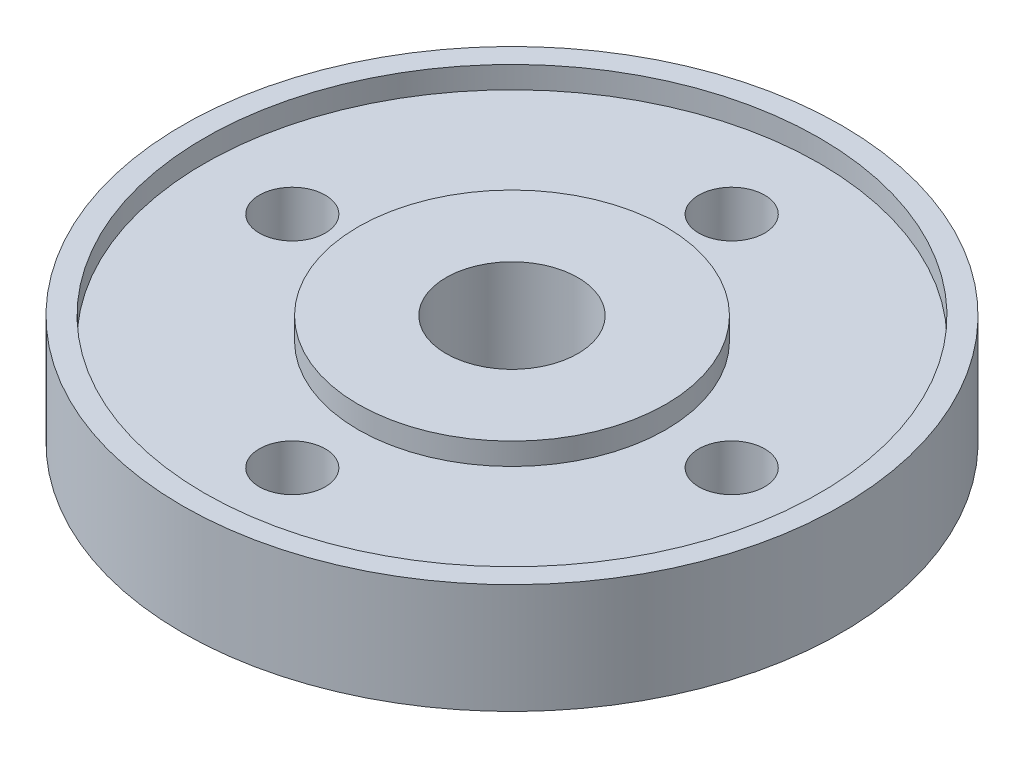
ISO-10303-21;
HEADER;
FILE_DESCRIPTION(('STEP AP214'),'2;1');
FILE_NAME('part.step','',(''),(''),'','','');
FILE_SCHEMA(('AUTOMOTIVE_DESIGN { 1 0 10303 214 1 1 1 1 }'));
ENDSEC;
DATA;
#1=APPLICATION_CONTEXT('core data for automotive mechanical design processes');
#2=APPLICATION_PROTOCOL_DEFINITION('international standard','automotive_design',2000,#1);
#3=PRODUCT_CONTEXT('',#1,'mechanical');
#4=PRODUCT('Part','Part','',(#3));
#5=PRODUCT_RELATED_PRODUCT_CATEGORY('part','',(#4));
#6=PRODUCT_DEFINITION_FORMATION('','',#4);
#7=PRODUCT_DEFINITION_CONTEXT('part definition',#1,'design');
#8=PRODUCT_DEFINITION('design','',#6,#7);
#9=PRODUCT_DEFINITION_SHAPE('','',#8);
#10=(LENGTH_UNIT() NAMED_UNIT(*) SI_UNIT(.MILLI.,.METRE.));
#11=(NAMED_UNIT(*) PLANE_ANGLE_UNIT() SI_UNIT($,.RADIAN.));
#12=(NAMED_UNIT(*) SI_UNIT($,.STERADIAN.) SOLID_ANGLE_UNIT());
#13=UNCERTAINTY_MEASURE_WITH_UNIT(LENGTH_MEASURE(1.E-05),#10,'distance_accuracy_value','');
#14=(GEOMETRIC_REPRESENTATION_CONTEXT(3) GLOBAL_UNCERTAINTY_ASSIGNED_CONTEXT((#13)) GLOBAL_UNIT_ASSIGNED_CONTEXT((#10,
#11,#12)) REPRESENTATION_CONTEXT('',''));
#15=CARTESIAN_POINT('',(0.,0.,0.));
#16=DIRECTION('',(0.,0.,1.));
#17=DIRECTION('',(1.,0.,0.));
#18=AXIS2_PLACEMENT_3D('',#15,#16,#17);
#19=CARTESIAN_POINT('',(0.,2.5,-10.));
#20=DIRECTION('',(0.,1.,0.));
#21=DIRECTION('',(0.,0.,1.));
#22=AXIS2_PLACEMENT_3D('',#19,#20,#21);
#23=CYLINDRICAL_SURFACE('',#22,1.5);
#24=CARTESIAN_POINT('',(0.,1.5,-10.));
#25=DIRECTION('',(0.,1.,0.));
#26=DIRECTION('',(0.,0.,1.));
#27=AXIS2_PLACEMENT_3D('',#24,#25,#26);
#28=CIRCLE('',#27,1.5);
#29=CARTESIAN_POINT('',(0.,1.5,-8.5));
#30=VERTEX_POINT('',#29);
#31=EDGE_CURVE('E72',#30,#30,#28,.F.);
#32=ORIENTED_EDGE('',*,*,#31,.F.);
#33=EDGE_LOOP('',(#32));
#34=FACE_BOUND('',#33,.T.);
#35=CARTESIAN_POINT('',(0.,-1.5,-10.));
#36=DIRECTION('',(0.,-1.,0.));
#37=DIRECTION('',(0.,0.,-1.));
#38=AXIS2_PLACEMENT_3D('',#35,#36,#37);
#39=CIRCLE('',#38,1.5);
#40=CARTESIAN_POINT('',(0.,-1.5,-11.5));
#41=VERTEX_POINT('',#40);
#42=EDGE_CURVE('E159',#41,#41,#39,.F.);
#43=ORIENTED_EDGE('',*,*,#42,.F.);
#44=EDGE_LOOP('',(#43));
#45=FACE_BOUND('',#44,.T.);
#46=ADVANCED_FACE('F31',(#34,#45),#23,.F.);
#47=CARTESIAN_POINT('',(10.,2.5,0.));
#48=DIRECTION('',(0.,1.,0.));
#49=DIRECTION('',(0.,0.,1.));
#50=AXIS2_PLACEMENT_3D('',#47,#48,#49);
#51=CYLINDRICAL_SURFACE('',#50,1.5);
#52=CARTESIAN_POINT('',(10.,1.5,0.));
#53=DIRECTION('',(0.,1.,0.));
#54=DIRECTION('',(0.,0.,1.));
#55=AXIS2_PLACEMENT_3D('',#52,#53,#54);
#56=CIRCLE('',#55,1.5);
#57=CARTESIAN_POINT('',(10.,1.5,1.50000000000003));
#58=VERTEX_POINT('',#57);
#59=EDGE_CURVE('E56',#58,#58,#56,.F.);
#60=ORIENTED_EDGE('',*,*,#59,.F.);
#61=EDGE_LOOP('',(#60));
#62=FACE_BOUND('',#61,.T.);
#63=CARTESIAN_POINT('',(10.,-1.5,0.));
#64=DIRECTION('',(0.,-1.,0.));
#65=DIRECTION('',(0.,0.,-1.));
#66=AXIS2_PLACEMENT_3D('',#63,#64,#65);
#67=CIRCLE('',#66,1.5);
#68=CARTESIAN_POINT('',(10.,-1.5,-1.49999999999996));
#69=VERTEX_POINT('',#68);
#70=EDGE_CURVE('E156',#69,#69,#67,.F.);
#71=ORIENTED_EDGE('',*,*,#70,.F.);
#72=EDGE_LOOP('',(#71));
#73=FACE_BOUND('',#72,.T.);
#74=ADVANCED_FACE('F99',(#62,#73),#51,.F.);
#75=CARTESIAN_POINT('',(0.,2.5,10.));
#76=DIRECTION('',(0.,1.,0.));
#77=DIRECTION('',(0.,0.,1.));
#78=AXIS2_PLACEMENT_3D('',#75,#76,#77);
#79=CYLINDRICAL_SURFACE('',#78,1.5);
#80=CARTESIAN_POINT('',(0.,1.5,10.));
#81=DIRECTION('',(0.,1.,0.));
#82=DIRECTION('',(0.,0.,1.));
#83=AXIS2_PLACEMENT_3D('',#80,#81,#82);
#84=CIRCLE('',#83,1.5);
#85=CARTESIAN_POINT('',(0.,1.5,11.5));
#86=VERTEX_POINT('',#85);
#87=EDGE_CURVE('E51',#86,#86,#84,.F.);
#88=ORIENTED_EDGE('',*,*,#87,.F.);
#89=EDGE_LOOP('',(#88));
#90=FACE_BOUND('',#89,.T.);
#91=CARTESIAN_POINT('',(0.,-1.5,10.));
#92=DIRECTION('',(0.,-1.,0.));
#93=DIRECTION('',(0.,0.,-1.));
#94=AXIS2_PLACEMENT_3D('',#91,#92,#93);
#95=CIRCLE('',#94,1.5);
#96=CARTESIAN_POINT('',(0.,-1.5,8.5));
#97=VERTEX_POINT('',#96);
#98=EDGE_CURVE('E153',#97,#97,#95,.F.);
#99=ORIENTED_EDGE('',*,*,#98,.F.);
#100=EDGE_LOOP('',(#99));
#101=FACE_BOUND('',#100,.T.);
#102=ADVANCED_FACE('F104',(#90,#101),#79,.F.);
#103=CARTESIAN_POINT('',(-10.,2.5,-1.04744440165294E-13));
#104=DIRECTION('',(0.,1.,0.));
#105=DIRECTION('',(0.,0.,1.));
#106=AXIS2_PLACEMENT_3D('',#103,#104,#105);
#107=CYLINDRICAL_SURFACE('',#106,1.5);
#108=CARTESIAN_POINT('',(-10.,1.5,-1.04744440165294E-13));
#109=DIRECTION('',(0.,1.,0.));
#110=DIRECTION('',(0.,0.,1.));
#111=AXIS2_PLACEMENT_3D('',#108,#109,#110);
#112=CIRCLE('',#111,1.5);
#113=CARTESIAN_POINT('',(-10.,1.5,1.49999999999989));
#114=VERTEX_POINT('',#113);
#115=EDGE_CURVE('E49',#114,#114,#112,.F.);
#116=ORIENTED_EDGE('',*,*,#115,.F.);
#117=EDGE_LOOP('',(#116));
#118=FACE_BOUND('',#117,.T.);
#119=CARTESIAN_POINT('',(-10.,-1.5,-1.04744440165294E-13));
#120=DIRECTION('',(0.,-1.,0.));
#121=DIRECTION('',(0.,0.,-1.));
#122=AXIS2_PLACEMENT_3D('',#119,#120,#121);
#123=CIRCLE('',#122,1.5);
#124=CARTESIAN_POINT('',(-10.,-1.5,-1.5000000000001));
#125=VERTEX_POINT('',#124);
#126=EDGE_CURVE('E35',#125,#125,#123,.F.);
#127=ORIENTED_EDGE('',*,*,#126,.F.);
#128=EDGE_LOOP('',(#127));
#129=FACE_BOUND('',#128,.T.);
#130=ADVANCED_FACE('F112',(#118,#129),#107,.F.);
#131=CARTESIAN_POINT('',(0.,-2.5,0.));
#132=DIRECTION('',(0.,1.,0.));
#133=DIRECTION('',(0.,0.,1.));
#134=AXIS2_PLACEMENT_3D('',#131,#132,#133);
#135=PLANE('',#134);
#136=CARTESIAN_POINT('',(0.,-2.5,0.));
#137=DIRECTION('',(0.,1.,0.));
#138=DIRECTION('',(0.,0.,1.));
#139=AXIS2_PLACEMENT_3D('',#136,#137,#138);
#140=CIRCLE('',#139,3.);
#141=CARTESIAN_POINT('',(0.,-2.5,3.));
#142=VERTEX_POINT('',#141);
#143=EDGE_CURVE('E47',#142,#142,#140,.T.);
#144=ORIENTED_EDGE('',*,*,#143,.T.);
#145=EDGE_LOOP('',(#144));
#146=FACE_BOUND('',#145,.T.);
#147=CARTESIAN_POINT('',(0.,-2.5,0.));
#148=DIRECTION('',(0.,1.,0.));
#149=DIRECTION('',(0.,0.,1.));
#150=AXIS2_PLACEMENT_3D('',#147,#148,#149);
#151=CIRCLE('',#150,7.);
#152=CARTESIAN_POINT('',(0.,-2.5,7.));
#153=VERTEX_POINT('',#152);
#154=EDGE_CURVE('E143',#153,#153,#151,.T.);
#155=ORIENTED_EDGE('',*,*,#154,.F.);
#156=EDGE_LOOP('',(#155));
#157=FACE_BOUND('',#156,.T.);
#158=ADVANCED_FACE('F80',(#146,#157),#135,.F.);
#159=CARTESIAN_POINT('',(0.,2.5,0.));
#160=DIRECTION('',(0.,1.,0.));
#161=DIRECTION('',(0.,0.,1.));
#162=AXIS2_PLACEMENT_3D('',#159,#160,#161);
#163=PLANE('',#162);
#164=CARTESIAN_POINT('',(0.,2.5,0.));
#165=DIRECTION('',(0.,1.,0.));
#166=DIRECTION('',(0.,0.,1.));
#167=AXIS2_PLACEMENT_3D('',#164,#165,#166);
#168=CIRCLE('',#167,3.);
#169=CARTESIAN_POINT('',(0.,2.5,3.));
#170=VERTEX_POINT('',#169);
#171=EDGE_CURVE('E44',#170,#170,#168,.T.);
#172=ORIENTED_EDGE('',*,*,#171,.F.);
#173=EDGE_LOOP('',(#172));
#174=FACE_BOUND('',#173,.T.);
#175=CARTESIAN_POINT('',(0.,2.5,0.));
#176=DIRECTION('',(0.,1.,0.));
#177=DIRECTION('',(0.,0.,1.));
#178=AXIS2_PLACEMENT_3D('',#175,#176,#177);
#179=CIRCLE('',#178,7.);
#180=CARTESIAN_POINT('',(0.,2.5,7.));
#181=VERTEX_POINT('',#180);
#182=EDGE_CURVE('E67',#181,#181,#179,.T.);
#183=ORIENTED_EDGE('',*,*,#182,.T.);
#184=EDGE_LOOP('',(#183));
#185=FACE_BOUND('',#184,.T.);
#186=ADVANCED_FACE('F166',(#174,#185),#163,.T.);
#187=CARTESIAN_POINT('',(0.,2.5,0.));
#188=DIRECTION('',(0.,1.,0.));
#189=DIRECTION('',(0.,0.,1.));
#190=AXIS2_PLACEMENT_3D('',#187,#188,#189);
#191=CIRCLE('',#190,14.);
#192=CARTESIAN_POINT('',(0.,2.5,14.));
#193=VERTEX_POINT('',#192);
#194=EDGE_CURVE('E59',#193,#193,#191,.T.);
#195=ORIENTED_EDGE('',*,*,#194,.F.);
#196=EDGE_LOOP('',(#195));
#197=FACE_BOUND('',#196,.T.);
#198=CARTESIAN_POINT('',(0.,2.5,0.));
#199=DIRECTION('',(0.,1.,0.));
#200=DIRECTION('',(0.,0.,1.));
#201=AXIS2_PLACEMENT_3D('',#198,#199,#200);
#202=CIRCLE('',#201,15.);
#203=CARTESIAN_POINT('',(0.,2.5,15.));
#204=VERTEX_POINT('',#203);
#205=EDGE_CURVE('E10',#204,#204,#202,.T.);
#206=ORIENTED_EDGE('',*,*,#205,.T.);
#207=EDGE_LOOP('',(#206));
#208=FACE_BOUND('',#207,.T.);
#209=ADVANCED_FACE('F169',(#197,#208),#163,.T.);
#210=CARTESIAN_POINT('',(0.,-2.5,0.));
#211=DIRECTION('',(0.,1.,0.));
#212=DIRECTION('',(0.,0.,1.));
#213=AXIS2_PLACEMENT_3D('',#210,#211,#212);
#214=CIRCLE('',#213,14.);
#215=CARTESIAN_POINT('',(0.,-2.5,14.));
#216=VERTEX_POINT('',#215);
#217=EDGE_CURVE('E145',#216,#216,#214,.T.);
#218=ORIENTED_EDGE('',*,*,#217,.T.);
#219=EDGE_LOOP('',(#218));
#220=FACE_BOUND('',#219,.T.);
#221=CARTESIAN_POINT('',(0.,-2.5,0.));
#222=DIRECTION('',(0.,1.,0.));
#223=DIRECTION('',(0.,0.,1.));
#224=AXIS2_PLACEMENT_3D('',#221,#222,#223);
#225=CIRCLE('',#224,15.);
#226=CARTESIAN_POINT('',(0.,-2.5,15.));
#227=VERTEX_POINT('',#226);
#228=EDGE_CURVE('E39',#227,#227,#225,.T.);
#229=ORIENTED_EDGE('',*,*,#228,.F.);
#230=EDGE_LOOP('',(#229));
#231=FACE_BOUND('',#230,.T.);
#232=ADVANCED_FACE('F94',(#220,#231),#135,.F.);
#233=CARTESIAN_POINT('',(0.,2.5,0.));
#234=DIRECTION('',(0.,-1.,0.));
#235=DIRECTION('',(0.,0.,-1.));
#236=AXIS2_PLACEMENT_3D('',#233,#234,#235);
#237=CYLINDRICAL_SURFACE('',#236,15.);
#238=ORIENTED_EDGE('',*,*,#205,.F.);
#239=EDGE_LOOP('',(#238));
#240=FACE_BOUND('',#239,.T.);
#241=ORIENTED_EDGE('',*,*,#228,.T.);
#242=EDGE_LOOP('',(#241));
#243=FACE_BOUND('',#242,.T.);
#244=ADVANCED_FACE('F33',(#240,#243),#237,.T.);
#245=CARTESIAN_POINT('',(0.,2.5,0.));
#246=DIRECTION('',(0.,-1.,0.));
#247=DIRECTION('',(0.,0.,-1.));
#248=AXIS2_PLACEMENT_3D('',#245,#246,#247);
#249=CYLINDRICAL_SURFACE('',#248,3.);
#250=ORIENTED_EDGE('',*,*,#171,.T.);
#251=EDGE_LOOP('',(#250));
#252=FACE_BOUND('',#251,.T.);
#253=ORIENTED_EDGE('',*,*,#143,.F.);
#254=EDGE_LOOP('',(#253));
#255=FACE_BOUND('',#254,.T.);
#256=ADVANCED_FACE('F83',(#252,#255),#249,.F.);
#257=CARTESIAN_POINT('',(0.,1.5,0.));
#258=DIRECTION('',(0.,1.,0.));
#259=DIRECTION('',(0.,0.,1.));
#260=AXIS2_PLACEMENT_3D('',#257,#258,#259);
#261=PLANE('',#260);
#262=CARTESIAN_POINT('',(0.,1.5,0.));
#263=DIRECTION('',(0.,1.,0.));
#264=DIRECTION('',(0.,0.,1.));
#265=AXIS2_PLACEMENT_3D('',#262,#263,#264);
#266=CIRCLE('',#265,7.);
#267=CARTESIAN_POINT('',(0.,1.5,7.));
#268=VERTEX_POINT('',#267);
#269=EDGE_CURVE('E64',#268,#268,#266,.T.);
#270=ORIENTED_EDGE('',*,*,#269,.F.);
#271=EDGE_LOOP('',(#270));
#272=FACE_BOUND('',#271,.T.);
#273=CARTESIAN_POINT('',(0.,1.5,0.));
#274=DIRECTION('',(0.,1.,0.));
#275=DIRECTION('',(0.,0.,1.));
#276=AXIS2_PLACEMENT_3D('',#273,#274,#275);
#277=CIRCLE('',#276,14.);
#278=CARTESIAN_POINT('',(0.,1.5,14.));
#279=VERTEX_POINT('',#278);
#280=EDGE_CURVE('E52',#279,#279,#277,.T.);
#281=ORIENTED_EDGE('',*,*,#280,.T.);
#282=EDGE_LOOP('',(#281));
#283=FACE_BOUND('',#282,.T.);
#284=ORIENTED_EDGE('',*,*,#115,.T.);
#285=EDGE_LOOP('',(#284));
#286=FACE_BOUND('',#285,.T.);
#287=ORIENTED_EDGE('',*,*,#87,.T.);
#288=EDGE_LOOP('',(#287));
#289=FACE_BOUND('',#288,.T.);
#290=ORIENTED_EDGE('',*,*,#59,.T.);
#291=EDGE_LOOP('',(#290));
#292=FACE_BOUND('',#291,.T.);
#293=ORIENTED_EDGE('',*,*,#31,.T.);
#294=EDGE_LOOP('',(#293));
#295=FACE_BOUND('',#294,.T.);
#296=ADVANCED_FACE('F85',(#272,#283,#286,#289,#292,#295),#261,.T.);
#297=CARTESIAN_POINT('',(0.,1.5,0.));
#298=DIRECTION('',(0.,1.,0.));
#299=DIRECTION('',(0.,0.,1.));
#300=AXIS2_PLACEMENT_3D('',#297,#298,#299);
#301=CYLINDRICAL_SURFACE('',#300,14.);
#302=ORIENTED_EDGE('',*,*,#280,.F.);
#303=EDGE_LOOP('',(#302));
#304=FACE_BOUND('',#303,.T.);
#305=ORIENTED_EDGE('',*,*,#194,.T.);
#306=EDGE_LOOP('',(#305));
#307=FACE_BOUND('',#306,.T.);
#308=ADVANCED_FACE('F91',(#304,#307),#301,.F.);
#309=CARTESIAN_POINT('',(0.,1.5,0.));
#310=DIRECTION('',(0.,1.,0.));
#311=DIRECTION('',(0.,0.,1.));
#312=AXIS2_PLACEMENT_3D('',#309,#310,#311);
#313=CYLINDRICAL_SURFACE('',#312,7.);
#314=ORIENTED_EDGE('',*,*,#269,.T.);
#315=EDGE_LOOP('',(#314));
#316=FACE_BOUND('',#315,.T.);
#317=ORIENTED_EDGE('',*,*,#182,.F.);
#318=EDGE_LOOP('',(#317));
#319=FACE_BOUND('',#318,.T.);
#320=ADVANCED_FACE('F118',(#316,#319),#313,.T.);
#321=CARTESIAN_POINT('',(0.,-1.5,0.));
#322=DIRECTION('',(0.,-1.,0.));
#323=DIRECTION('',(0.,0.,1.));
#324=AXIS2_PLACEMENT_3D('',#321,#322,#323);
#325=PLANE('',#324);
#326=CARTESIAN_POINT('',(0.,-1.5,0.));
#327=DIRECTION('',(0.,1.,0.));
#328=DIRECTION('',(0.,0.,1.));
#329=AXIS2_PLACEMENT_3D('',#326,#327,#328);
#330=CIRCLE('',#329,14.);
#331=CARTESIAN_POINT('',(0.,-1.5,14.));
#332=VERTEX_POINT('',#331);
#333=EDGE_CURVE('E148',#332,#332,#330,.T.);
#334=ORIENTED_EDGE('',*,*,#333,.F.);
#335=EDGE_LOOP('',(#334));
#336=FACE_BOUND('',#335,.T.);
#337=CARTESIAN_POINT('',(0.,-1.5,0.));
#338=DIRECTION('',(0.,1.,0.));
#339=DIRECTION('',(0.,0.,1.));
#340=AXIS2_PLACEMENT_3D('',#337,#338,#339);
#341=CIRCLE('',#340,7.);
#342=CARTESIAN_POINT('',(0.,-1.5,7.));
#343=VERTEX_POINT('',#342);
#344=EDGE_CURVE('E140',#343,#343,#341,.T.);
#345=ORIENTED_EDGE('',*,*,#344,.T.);
#346=EDGE_LOOP('',(#345));
#347=FACE_BOUND('',#346,.T.);
#348=ORIENTED_EDGE('',*,*,#126,.T.);
#349=EDGE_LOOP('',(#348));
#350=FACE_BOUND('',#349,.T.);
#351=ORIENTED_EDGE('',*,*,#98,.T.);
#352=EDGE_LOOP('',(#351));
#353=FACE_BOUND('',#352,.T.);
#354=ORIENTED_EDGE('',*,*,#70,.T.);
#355=EDGE_LOOP('',(#354));
#356=FACE_BOUND('',#355,.T.);
#357=ORIENTED_EDGE('',*,*,#42,.T.);
#358=EDGE_LOOP('',(#357));
#359=FACE_BOUND('',#358,.T.);
#360=ADVANCED_FACE('F123',(#336,#347,#350,#353,#356,#359),#325,.T.);
#361=CARTESIAN_POINT('',(0.,-1.5,0.));
#362=DIRECTION('',(0.,-1.,0.));
#363=DIRECTION('',(0.,0.,-1.));
#364=AXIS2_PLACEMENT_3D('',#361,#362,#363);
#365=CYLINDRICAL_SURFACE('',#364,14.);
#366=ORIENTED_EDGE('',*,*,#333,.T.);
#367=EDGE_LOOP('',(#366));
#368=FACE_BOUND('',#367,.T.);
#369=ORIENTED_EDGE('',*,*,#217,.F.);
#370=EDGE_LOOP('',(#369));
#371=FACE_BOUND('',#370,.T.);
#372=ADVANCED_FACE('F125',(#368,#371),#365,.F.);
#373=CARTESIAN_POINT('',(0.,-1.5,0.));
#374=DIRECTION('',(0.,-1.,0.));
#375=DIRECTION('',(0.,0.,-1.));
#376=AXIS2_PLACEMENT_3D('',#373,#374,#375);
#377=CYLINDRICAL_SURFACE('',#376,7.);
#378=ORIENTED_EDGE('',*,*,#344,.F.);
#379=EDGE_LOOP('',(#378));
#380=FACE_BOUND('',#379,.T.);
#381=ORIENTED_EDGE('',*,*,#154,.T.);
#382=EDGE_LOOP('',(#381));
#383=FACE_BOUND('',#382,.T.);
#384=ADVANCED_FACE('F128',(#380,#383),#377,.T.);
#385=CLOSED_SHELL('',(#46,#74,#102,#130,#158,#186,#209,#232,#244,#256,#296,#308,#320,#360,#372,#384));
#386=MANIFOLD_SOLID_BREP('B2',#385);
#387=ADVANCED_BREP_SHAPE_REPRESENTATION('',(#18,#386),#14);
#388=SHAPE_DEFINITION_REPRESENTATION(#9,#387);
ENDSEC;
END-ISO-10303-21;
